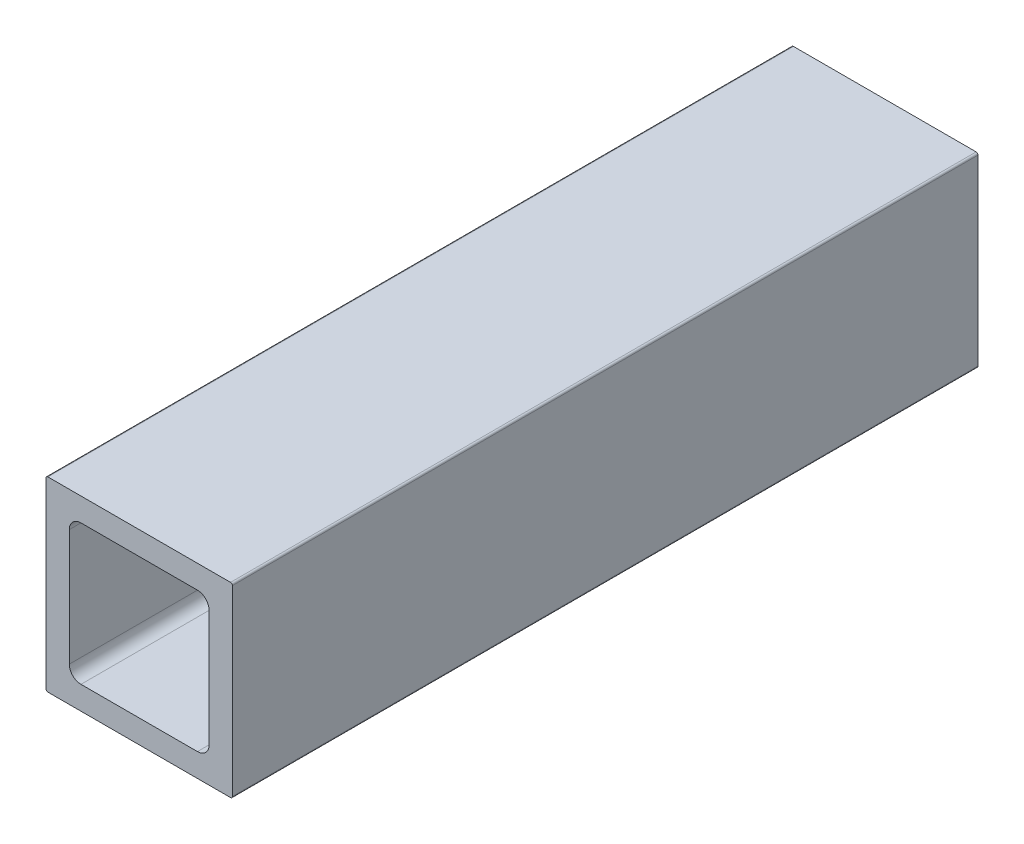
ISO-10303-21;
HEADER;
FILE_DESCRIPTION(('STEP AP214'),'2;1');
FILE_NAME('part.step','',(''),(''),'','','');
FILE_SCHEMA(('AUTOMOTIVE_DESIGN { 1 0 10303 214 1 1 1 1 }'));
ENDSEC;
DATA;
#1=APPLICATION_CONTEXT('core data for automotive mechanical design processes');
#2=APPLICATION_PROTOCOL_DEFINITION('international standard','automotive_design',2000,#1);
#3=PRODUCT_CONTEXT('',#1,'mechanical');
#4=PRODUCT('Part','Part','',(#3));
#5=PRODUCT_RELATED_PRODUCT_CATEGORY('part','',(#4));
#6=PRODUCT_DEFINITION_FORMATION('','',#4);
#7=PRODUCT_DEFINITION_CONTEXT('part definition',#1,'design');
#8=PRODUCT_DEFINITION('design','',#6,#7);
#9=PRODUCT_DEFINITION_SHAPE('','',#8);
#10=(LENGTH_UNIT() NAMED_UNIT(*) SI_UNIT(.MILLI.,.METRE.));
#11=(NAMED_UNIT(*) PLANE_ANGLE_UNIT() SI_UNIT($,.RADIAN.));
#12=(NAMED_UNIT(*) SI_UNIT($,.STERADIAN.) SOLID_ANGLE_UNIT());
#13=UNCERTAINTY_MEASURE_WITH_UNIT(LENGTH_MEASURE(1.E-05),#10,'distance_accuracy_value','');
#14=(GEOMETRIC_REPRESENTATION_CONTEXT(3) GLOBAL_UNCERTAINTY_ASSIGNED_CONTEXT((#13)) GLOBAL_UNIT_ASSIGNED_CONTEXT((#10,
#11,#12)) REPRESENTATION_CONTEXT('',''));
#15=CARTESIAN_POINT('',(0.,0.,0.));
#16=DIRECTION('',(0.,0.,1.));
#17=DIRECTION('',(1.,0.,0.));
#18=AXIS2_PLACEMENT_3D('',#15,#16,#17);
#19=CARTESIAN_POINT('',(3.175,4.7625,1828.8));
#20=DIRECTION('',(1.,0.,0.));
#21=DIRECTION('',(0.,1.,0.));
#22=AXIS2_PLACEMENT_3D('',#19,#20,#21);
#23=PLANE('',#22);
#24=DIRECTION('',(0.,-1.,0.));
#25=VECTOR('',#24,1.);
#26=CARTESIAN_POINT('',(3.175,4.7625,1727.2));
#27=LINE('',#26,#25);
#28=CARTESIAN_POINT('',(3.175,20.6375,1727.2));
#29=VERTEX_POINT('',#28);
#30=CARTESIAN_POINT('',(3.175,4.7625,1727.2));
#31=VERTEX_POINT('',#30);
#32=EDGE_CURVE('E58',#29,#31,#27,.T.);
#33=ORIENTED_EDGE('',*,*,#32,.F.);
#34=DIRECTION('',(0.,0.,-1.));
#35=VECTOR('',#34,1.);
#36=CARTESIAN_POINT('',(3.175,20.6375,1828.8));
#37=LINE('',#36,#35);
#38=CARTESIAN_POINT('',(3.175,20.6375,1828.8));
#39=VERTEX_POINT('',#38);
#40=EDGE_CURVE('E51',#39,#29,#37,.T.);
#41=ORIENTED_EDGE('',*,*,#40,.F.);
#42=DIRECTION('',(0.,-1.,0.));
#43=VECTOR('',#42,1.);
#44=CARTESIAN_POINT('',(3.175,4.7625,1828.8));
#45=LINE('',#44,#43);
#46=CARTESIAN_POINT('',(3.175,4.7625,1828.8));
#47=VERTEX_POINT('',#46);
#48=EDGE_CURVE('E217',#39,#47,#45,.T.);
#49=ORIENTED_EDGE('',*,*,#48,.T.);
#50=DIRECTION('',(0.,0.,-1.));
#51=VECTOR('',#50,1.);
#52=CARTESIAN_POINT('',(3.175,4.7625,1828.8));
#53=LINE('',#52,#51);
#54=EDGE_CURVE('E323',#47,#31,#53,.T.);
#55=ORIENTED_EDGE('',*,*,#54,.T.);
#56=EDGE_LOOP('',(#33,#41,#49,#55));
#57=FACE_BOUND('',#56,.T.);
#58=ADVANCED_FACE('F43',(#57),#23,.T.);
#59=CARTESIAN_POINT('',(4.7625,20.6375,1828.8));
#60=DIRECTION('',(0.,0.,-1.));
#61=DIRECTION('',(-1.,0.,0.));
#62=AXIS2_PLACEMENT_3D('',#59,#60,#61);
#63=CYLINDRICAL_SURFACE('',#62,1.5875);
#64=ORIENTED_EDGE('',*,*,#40,.T.);
#65=CARTESIAN_POINT('',(4.7625,20.6375,1727.2));
#66=DIRECTION('',(0.,0.,1.));
#67=DIRECTION('',(1.,0.,0.));
#68=AXIS2_PLACEMENT_3D('',#65,#66,#67);
#69=CIRCLE('',#68,1.5875);
#70=CARTESIAN_POINT('',(4.7625,22.225,1727.2));
#71=VERTEX_POINT('',#70);
#72=EDGE_CURVE('E302',#29,#71,#69,.F.);
#73=ORIENTED_EDGE('',*,*,#72,.T.);
#74=DIRECTION('',(0.,0.,-1.));
#75=VECTOR('',#74,1.);
#76=CARTESIAN_POINT('',(4.7625,22.225,1828.8));
#77=LINE('',#76,#75);
#78=CARTESIAN_POINT('',(4.7625,22.225,1828.8));
#79=VERTEX_POINT('',#78);
#80=EDGE_CURVE('E290',#79,#71,#77,.T.);
#81=ORIENTED_EDGE('',*,*,#80,.F.);
#82=CARTESIAN_POINT('',(4.7625,20.6375,1828.8));
#83=DIRECTION('',(0.,0.,1.));
#84=DIRECTION('',(-1.,0.,0.));
#85=AXIS2_PLACEMENT_3D('',#82,#83,#84);
#86=CIRCLE('',#85,1.5875);
#87=EDGE_CURVE('E222',#79,#39,#86,.T.);
#88=ORIENTED_EDGE('',*,*,#87,.T.);
#89=EDGE_LOOP('',(#64,#73,#81,#88));
#90=FACE_BOUND('',#89,.T.);
#91=ADVANCED_FACE('F300',(#90),#63,.F.);
#92=CARTESIAN_POINT('',(4.7625,22.225,1828.8));
#93=DIRECTION('',(0.,-1.,0.));
#94=DIRECTION('',(0.,0.,-1.));
#95=AXIS2_PLACEMENT_3D('',#92,#93,#94);
#96=PLANE('',#95);
#97=DIRECTION('',(-1.,0.,0.));
#98=VECTOR('',#97,1.);
#99=CARTESIAN_POINT('',(4.7625,22.225,1727.2));
#100=LINE('',#99,#98);
#101=CARTESIAN_POINT('',(20.6375,22.225,1727.2));
#102=VERTEX_POINT('',#101);
#103=EDGE_CURVE('E338',#102,#71,#100,.T.);
#104=ORIENTED_EDGE('',*,*,#103,.F.);
#105=DIRECTION('',(0.,0.,-1.));
#106=VECTOR('',#105,1.);
#107=CARTESIAN_POINT('',(20.6375,22.225,1828.8));
#108=LINE('',#107,#106);
#109=CARTESIAN_POINT('',(20.6375,22.225,1828.8));
#110=VERTEX_POINT('',#109);
#111=EDGE_CURVE('E237',#110,#102,#108,.T.);
#112=ORIENTED_EDGE('',*,*,#111,.F.);
#113=DIRECTION('',(-1.,0.,0.));
#114=VECTOR('',#113,1.);
#115=CARTESIAN_POINT('',(4.7625,22.225,1828.8));
#116=LINE('',#115,#114);
#117=EDGE_CURVE('E226',#110,#79,#116,.T.);
#118=ORIENTED_EDGE('',*,*,#117,.T.);
#119=ORIENTED_EDGE('',*,*,#80,.T.);
#120=EDGE_LOOP('',(#104,#112,#118,#119));
#121=FACE_BOUND('',#120,.T.);
#122=ADVANCED_FACE('F289',(#121),#96,.T.);
#123=CARTESIAN_POINT('',(20.6375,20.6375,1828.8));
#124=DIRECTION('',(0.,0.,-1.));
#125=DIRECTION('',(-1.,0.,0.));
#126=AXIS2_PLACEMENT_3D('',#123,#124,#125);
#127=CYLINDRICAL_SURFACE('',#126,1.5875);
#128=ORIENTED_EDGE('',*,*,#111,.T.);
#129=CARTESIAN_POINT('',(20.6375,20.6375,1727.2));
#130=DIRECTION('',(0.,0.,1.));
#131=DIRECTION('',(1.,0.,0.));
#132=AXIS2_PLACEMENT_3D('',#129,#130,#131);
#133=CIRCLE('',#132,1.5875);
#134=CARTESIAN_POINT('',(22.225,20.6375,1727.2));
#135=VERTEX_POINT('',#134);
#136=EDGE_CURVE('E340',#102,#135,#133,.F.);
#137=ORIENTED_EDGE('',*,*,#136,.T.);
#138=DIRECTION('',(0.,0.,-1.));
#139=VECTOR('',#138,1.);
#140=CARTESIAN_POINT('',(22.225,20.6375,1828.8));
#141=LINE('',#140,#139);
#142=CARTESIAN_POINT('',(22.225,20.6375,1828.8));
#143=VERTEX_POINT('',#142);
#144=EDGE_CURVE('E233',#143,#135,#141,.T.);
#145=ORIENTED_EDGE('',*,*,#144,.F.);
#146=CARTESIAN_POINT('',(20.6375,20.6375,1828.8));
#147=DIRECTION('',(0.,0.,1.));
#148=DIRECTION('',(-1.,0.,0.));
#149=AXIS2_PLACEMENT_3D('',#146,#147,#148);
#150=CIRCLE('',#149,1.5875);
#151=EDGE_CURVE('E212',#143,#110,#150,.T.);
#152=ORIENTED_EDGE('',*,*,#151,.T.);
#153=EDGE_LOOP('',(#128,#137,#145,#152));
#154=FACE_BOUND('',#153,.T.);
#155=ADVANCED_FACE('F525',(#154),#127,.F.);
#156=CARTESIAN_POINT('',(22.225,4.7625,1828.8));
#157=DIRECTION('',(-1.,0.,0.));
#158=DIRECTION('',(0.,0.,1.));
#159=AXIS2_PLACEMENT_3D('',#156,#157,#158);
#160=PLANE('',#159);
#161=DIRECTION('',(0.,1.,0.));
#162=VECTOR('',#161,1.);
#163=CARTESIAN_POINT('',(22.225,4.7625,1727.2));
#164=LINE('',#163,#162);
#165=CARTESIAN_POINT('',(22.225,4.7625,1727.2));
#166=VERTEX_POINT('',#165);
#167=EDGE_CURVE('E343',#166,#135,#164,.T.);
#168=ORIENTED_EDGE('',*,*,#167,.F.);
#169=DIRECTION('',(0.,0.,-1.));
#170=VECTOR('',#169,1.);
#171=CARTESIAN_POINT('',(22.225,4.7625,1828.8));
#172=LINE('',#171,#170);
#173=CARTESIAN_POINT('',(22.225,4.7625,1828.8));
#174=VERTEX_POINT('',#173);
#175=EDGE_CURVE('E238',#174,#166,#172,.T.);
#176=ORIENTED_EDGE('',*,*,#175,.F.);
#177=DIRECTION('',(0.,1.,0.));
#178=VECTOR('',#177,1.);
#179=CARTESIAN_POINT('',(22.225,4.7625,1828.8));
#180=LINE('',#179,#178);
#181=EDGE_CURVE('E207',#174,#143,#180,.T.);
#182=ORIENTED_EDGE('',*,*,#181,.T.);
#183=ORIENTED_EDGE('',*,*,#144,.T.);
#184=EDGE_LOOP('',(#168,#176,#182,#183));
#185=FACE_BOUND('',#184,.T.);
#186=ADVANCED_FACE('F395',(#185),#160,.T.);
#187=CARTESIAN_POINT('',(20.6375,4.7625,1828.8));
#188=DIRECTION('',(0.,0.,-1.));
#189=DIRECTION('',(-1.,0.,0.));
#190=AXIS2_PLACEMENT_3D('',#187,#188,#189);
#191=CYLINDRICAL_SURFACE('',#190,1.5875);
#192=ORIENTED_EDGE('',*,*,#175,.T.);
#193=CARTESIAN_POINT('',(20.6375,4.7625,1727.2));
#194=DIRECTION('',(0.,0.,1.));
#195=DIRECTION('',(1.,0.,0.));
#196=AXIS2_PLACEMENT_3D('',#193,#194,#195);
#197=CIRCLE('',#196,1.5875);
#198=CARTESIAN_POINT('',(20.6375,3.175,1727.2));
#199=VERTEX_POINT('',#198);
#200=EDGE_CURVE('E345',#166,#199,#197,.F.);
#201=ORIENTED_EDGE('',*,*,#200,.T.);
#202=DIRECTION('',(0.,0.,-1.));
#203=VECTOR('',#202,1.);
#204=CARTESIAN_POINT('',(20.6375,3.175,1828.8));
#205=LINE('',#204,#203);
#206=CARTESIAN_POINT('',(20.6375,3.175,1828.8));
#207=VERTEX_POINT('',#206);
#208=EDGE_CURVE('E264',#207,#199,#205,.T.);
#209=ORIENTED_EDGE('',*,*,#208,.F.);
#210=CARTESIAN_POINT('',(20.6375,4.7625,1828.8));
#211=DIRECTION('',(0.,0.,1.));
#212=DIRECTION('',(-1.,0.,0.));
#213=AXIS2_PLACEMENT_3D('',#210,#211,#212);
#214=CIRCLE('',#213,1.5875);
#215=EDGE_CURVE('E211',#207,#174,#214,.T.);
#216=ORIENTED_EDGE('',*,*,#215,.T.);
#217=EDGE_LOOP('',(#192,#201,#209,#216));
#218=FACE_BOUND('',#217,.T.);
#219=ADVANCED_FACE('F392',(#218),#191,.F.);
#220=CARTESIAN_POINT('',(4.7625,3.175,1828.8));
#221=DIRECTION('',(0.,1.,0.));
#222=DIRECTION('',(1.,0.,0.));
#223=AXIS2_PLACEMENT_3D('',#220,#221,#222);
#224=PLANE('',#223);
#225=DIRECTION('',(1.,0.,0.));
#226=VECTOR('',#225,1.);
#227=CARTESIAN_POINT('',(4.7625,3.175,1727.2));
#228=LINE('',#227,#226);
#229=CARTESIAN_POINT('',(4.7625,3.175,1727.2));
#230=VERTEX_POINT('',#229);
#231=EDGE_CURVE('E348',#230,#199,#228,.T.);
#232=ORIENTED_EDGE('',*,*,#231,.F.);
#233=DIRECTION('',(0.,0.,-1.));
#234=VECTOR('',#233,1.);
#235=CARTESIAN_POINT('',(4.7625,3.175,1828.8));
#236=LINE('',#235,#234);
#237=CARTESIAN_POINT('',(4.7625,3.175,1828.8));
#238=VERTEX_POINT('',#237);
#239=EDGE_CURVE('E268',#238,#230,#236,.T.);
#240=ORIENTED_EDGE('',*,*,#239,.F.);
#241=DIRECTION('',(1.,0.,0.));
#242=VECTOR('',#241,1.);
#243=CARTESIAN_POINT('',(4.7625,3.175,1828.8));
#244=LINE('',#243,#242);
#245=EDGE_CURVE('E254',#238,#207,#244,.T.);
#246=ORIENTED_EDGE('',*,*,#245,.T.);
#247=ORIENTED_EDGE('',*,*,#208,.T.);
#248=EDGE_LOOP('',(#232,#240,#246,#247));
#249=FACE_BOUND('',#248,.T.);
#250=ADVANCED_FACE('F394',(#249),#224,.T.);
#251=CARTESIAN_POINT('',(4.7625,4.7625,1828.8));
#252=DIRECTION('',(0.,0.,-1.));
#253=DIRECTION('',(-1.,0.,0.));
#254=AXIS2_PLACEMENT_3D('',#251,#252,#253);
#255=CYLINDRICAL_SURFACE('',#254,1.5875);
#256=ORIENTED_EDGE('',*,*,#239,.T.);
#257=CARTESIAN_POINT('',(4.7625,4.7625,1727.2));
#258=DIRECTION('',(0.,0.,1.));
#259=DIRECTION('',(1.,0.,0.));
#260=AXIS2_PLACEMENT_3D('',#257,#258,#259);
#261=CIRCLE('',#260,1.5875);
#262=EDGE_CURVE('E350',#230,#31,#261,.F.);
#263=ORIENTED_EDGE('',*,*,#262,.T.);
#264=ORIENTED_EDGE('',*,*,#54,.F.);
#265=CARTESIAN_POINT('',(4.7625,4.7625,1828.8));
#266=DIRECTION('',(0.,0.,1.));
#267=DIRECTION('',(1.,0.,0.));
#268=AXIS2_PLACEMENT_3D('',#265,#266,#267);
#269=CIRCLE('',#268,1.5875);
#270=EDGE_CURVE('E213',#47,#238,#269,.T.);
#271=ORIENTED_EDGE('',*,*,#270,.T.);
#272=EDGE_LOOP('',(#256,#263,#264,#271));
#273=FACE_BOUND('',#272,.T.);
#274=ADVANCED_FACE('F508',(#273),#255,.F.);
#275=CARTESIAN_POINT('',(0.,0.254,1828.8));
#276=DIRECTION('',(1.,0.,0.));
#277=DIRECTION('',(0.,1.,0.));
#278=AXIS2_PLACEMENT_3D('',#275,#276,#277);
#279=PLANE('',#278);
#280=DIRECTION('',(0.,0.,-1.));
#281=VECTOR('',#280,1.);
#282=CARTESIAN_POINT('',(0.,25.146,1828.8));
#283=LINE('',#282,#281);
#284=CARTESIAN_POINT('',(0.,25.146,1828.8));
#285=VERTEX_POINT('',#284);
#286=CARTESIAN_POINT('',(0.,25.146,1727.2));
#287=VERTEX_POINT('',#286);
#288=EDGE_CURVE('E263',#285,#287,#283,.T.);
#289=ORIENTED_EDGE('',*,*,#288,.T.);
#290=DIRECTION('',(0.,-1.,0.));
#291=VECTOR('',#290,1.);
#292=CARTESIAN_POINT('',(0.,0.254,1727.2));
#293=LINE('',#292,#291);
#294=CARTESIAN_POINT('',(0.,0.254,1727.2));
#295=VERTEX_POINT('',#294);
#296=EDGE_CURVE('E185',#287,#295,#293,.T.);
#297=ORIENTED_EDGE('',*,*,#296,.T.);
#298=DIRECTION('',(0.,0.,-1.));
#299=VECTOR('',#298,1.);
#300=CARTESIAN_POINT('',(0.,0.254,1828.8));
#301=LINE('',#300,#299);
#302=CARTESIAN_POINT('',(0.,0.254,1828.8));
#303=VERTEX_POINT('',#302);
#304=EDGE_CURVE('E194',#303,#295,#301,.T.);
#305=ORIENTED_EDGE('',*,*,#304,.F.);
#306=DIRECTION('',(0.,-1.,0.));
#307=VECTOR('',#306,1.);
#308=CARTESIAN_POINT('',(0.,0.254,1828.8));
#309=LINE('',#308,#307);
#310=EDGE_CURVE('E218',#285,#303,#309,.T.);
#311=ORIENTED_EDGE('',*,*,#310,.F.);
#312=EDGE_LOOP('',(#289,#297,#305,#311));
#313=FACE_BOUND('',#312,.T.);
#314=ADVANCED_FACE('F502',(#313),#279,.F.);
#315=CARTESIAN_POINT('',(0.254,25.146,1828.8));
#316=DIRECTION('',(0.,0.,-1.));
#317=DIRECTION('',(-1.,0.,0.));
#318=AXIS2_PLACEMENT_3D('',#315,#316,#317);
#319=CYLINDRICAL_SURFACE('',#318,0.254);
#320=CARTESIAN_POINT('',(0.254,25.146,1727.2));
#321=DIRECTION('',(0.,0.,1.));
#322=DIRECTION('',(1.,0.,0.));
#323=AXIS2_PLACEMENT_3D('',#320,#321,#322);
#324=CIRCLE('',#323,0.254);
#325=CARTESIAN_POINT('',(0.254000000000004,25.4,1727.2));
#326=VERTEX_POINT('',#325);
#327=EDGE_CURVE('E176',#287,#326,#324,.F.);
#328=ORIENTED_EDGE('',*,*,#327,.F.);
#329=ORIENTED_EDGE('',*,*,#288,.F.);
#330=CARTESIAN_POINT('',(0.254,25.146,1828.8));
#331=DIRECTION('',(0.,0.,1.));
#332=DIRECTION('',(-1.,0.,0.));
#333=AXIS2_PLACEMENT_3D('',#330,#331,#332);
#334=CIRCLE('',#333,0.254);
#335=CARTESIAN_POINT('',(0.254,25.4,1828.8));
#336=VERTEX_POINT('',#335);
#337=EDGE_CURVE('E239',#336,#285,#334,.T.);
#338=ORIENTED_EDGE('',*,*,#337,.F.);
#339=DIRECTION('',(0.,0.,-1.));
#340=VECTOR('',#339,1.);
#341=CARTESIAN_POINT('',(0.254,25.4,1828.8));
#342=LINE('',#341,#340);
#343=EDGE_CURVE('E259',#336,#326,#342,.T.);
#344=ORIENTED_EDGE('',*,*,#343,.T.);
#345=EDGE_LOOP('',(#328,#329,#338,#344));
#346=FACE_BOUND('',#345,.T.);
#347=ADVANCED_FACE('F507',(#346),#319,.T.);
#348=CARTESIAN_POINT('',(0.254,25.4,1828.8));
#349=DIRECTION('',(0.,-1.,0.));
#350=DIRECTION('',(0.,0.,-1.));
#351=AXIS2_PLACEMENT_3D('',#348,#349,#350);
#352=PLANE('',#351);
#353=DIRECTION('',(0.,0.,-1.));
#354=VECTOR('',#353,1.);
#355=CARTESIAN_POINT('',(25.146,25.4,1828.8));
#356=LINE('',#355,#354);
#357=CARTESIAN_POINT('',(25.146,25.4,1828.8));
#358=VERTEX_POINT('',#357);
#359=CARTESIAN_POINT('',(25.146,25.4,1727.2));
#360=VERTEX_POINT('',#359);
#361=EDGE_CURVE('E255',#358,#360,#356,.T.);
#362=ORIENTED_EDGE('',*,*,#361,.T.);
#363=DIRECTION('',(1.,0.,0.));
#364=VECTOR('',#363,1.);
#365=CARTESIAN_POINT('',(-135.222379220066,25.4,1727.2));
#366=LINE('',#365,#364);
#367=EDGE_CURVE('E186',#326,#360,#366,.T.);
#368=ORIENTED_EDGE('',*,*,#367,.F.);
#369=ORIENTED_EDGE('',*,*,#343,.F.);
#370=DIRECTION('',(-1.,0.,0.));
#371=VECTOR('',#370,1.);
#372=CARTESIAN_POINT('',(0.254,25.4,1828.8));
#373=LINE('',#372,#371);
#374=EDGE_CURVE('E231',#358,#336,#373,.T.);
#375=ORIENTED_EDGE('',*,*,#374,.F.);
#376=EDGE_LOOP('',(#362,#368,#369,#375));
#377=FACE_BOUND('',#376,.T.);
#378=ADVANCED_FACE('F365',(#377),#352,.F.);
#379=CARTESIAN_POINT('',(25.146,25.146,1828.8));
#380=DIRECTION('',(0.,0.,-1.));
#381=DIRECTION('',(-1.,0.,0.));
#382=AXIS2_PLACEMENT_3D('',#379,#380,#381);
#383=CYLINDRICAL_SURFACE('',#382,0.254);
#384=CARTESIAN_POINT('',(25.146,25.146,1727.2));
#385=DIRECTION('',(0.,0.,1.));
#386=DIRECTION('',(1.,0.,0.));
#387=AXIS2_PLACEMENT_3D('',#384,#385,#386);
#388=CIRCLE('',#387,0.254);
#389=CARTESIAN_POINT('',(25.4,25.146,1727.2));
#390=VERTEX_POINT('',#389);
#391=EDGE_CURVE('E352',#360,#390,#388,.F.);
#392=ORIENTED_EDGE('',*,*,#391,.F.);
#393=ORIENTED_EDGE('',*,*,#361,.F.);
#394=CARTESIAN_POINT('',(25.146,25.146,1828.8));
#395=DIRECTION('',(0.,0.,1.));
#396=DIRECTION('',(-1.,0.,0.));
#397=AXIS2_PLACEMENT_3D('',#394,#395,#396);
#398=CIRCLE('',#397,0.254);
#399=CARTESIAN_POINT('',(25.4,25.146,1828.8));
#400=VERTEX_POINT('',#399);
#401=EDGE_CURVE('E227',#400,#358,#398,.T.);
#402=ORIENTED_EDGE('',*,*,#401,.F.);
#403=DIRECTION('',(0.,0.,-1.));
#404=VECTOR('',#403,1.);
#405=CARTESIAN_POINT('',(25.4,25.146,1828.8));
#406=LINE('',#405,#404);
#407=EDGE_CURVE('E200',#400,#390,#406,.T.);
#408=ORIENTED_EDGE('',*,*,#407,.T.);
#409=EDGE_LOOP('',(#392,#393,#402,#408));
#410=FACE_BOUND('',#409,.T.);
#411=ADVANCED_FACE('F45',(#410),#383,.T.);
#412=CARTESIAN_POINT('',(25.4,0.254,1828.8));
#413=DIRECTION('',(-1.,0.,0.));
#414=DIRECTION('',(0.,0.,1.));
#415=AXIS2_PLACEMENT_3D('',#412,#413,#414);
#416=PLANE('',#415);
#417=DIRECTION('',(0.,0.,-1.));
#418=VECTOR('',#417,1.);
#419=CARTESIAN_POINT('',(25.4,0.254,1828.8));
#420=LINE('',#419,#418);
#421=CARTESIAN_POINT('',(25.4,0.254,1828.8));
#422=VERTEX_POINT('',#421);
#423=CARTESIAN_POINT('',(25.4,0.254,1727.2));
#424=VERTEX_POINT('',#423);
#425=EDGE_CURVE('E193',#422,#424,#420,.T.);
#426=ORIENTED_EDGE('',*,*,#425,.T.);
#427=DIRECTION('',(0.,1.,0.));
#428=VECTOR('',#427,1.);
#429=CARTESIAN_POINT('',(25.4,0.254,1727.2));
#430=LINE('',#429,#428);
#431=EDGE_CURVE('E172',#424,#390,#430,.T.);
#432=ORIENTED_EDGE('',*,*,#431,.T.);
#433=ORIENTED_EDGE('',*,*,#407,.F.);
#434=DIRECTION('',(0.,1.,0.));
#435=VECTOR('',#434,1.);
#436=CARTESIAN_POINT('',(25.4,0.254,1828.8));
#437=LINE('',#436,#435);
#438=EDGE_CURVE('E232',#422,#400,#437,.T.);
#439=ORIENTED_EDGE('',*,*,#438,.F.);
#440=EDGE_LOOP('',(#426,#432,#433,#439));
#441=FACE_BOUND('',#440,.T.);
#442=ADVANCED_FACE('F369',(#441),#416,.F.);
#443=CARTESIAN_POINT('',(25.146,0.254,1828.8));
#444=DIRECTION('',(0.,0.,-1.));
#445=DIRECTION('',(-1.,0.,0.));
#446=AXIS2_PLACEMENT_3D('',#443,#444,#445);
#447=CYLINDRICAL_SURFACE('',#446,0.254);
#448=CARTESIAN_POINT('',(25.146,0.254,1727.2));
#449=DIRECTION('',(0.,0.,1.));
#450=DIRECTION('',(1.,0.,0.));
#451=AXIS2_PLACEMENT_3D('',#448,#449,#450);
#452=CIRCLE('',#451,0.254);
#453=CARTESIAN_POINT('',(25.146,0.,1727.2));
#454=VERTEX_POINT('',#453);
#455=EDGE_CURVE('E169',#424,#454,#452,.F.);
#456=ORIENTED_EDGE('',*,*,#455,.F.);
#457=ORIENTED_EDGE('',*,*,#425,.F.);
#458=CARTESIAN_POINT('',(25.146,0.254,1828.8));
#459=DIRECTION('',(0.,0.,1.));
#460=DIRECTION('',(1.,0.,0.));
#461=AXIS2_PLACEMENT_3D('',#458,#459,#460);
#462=CIRCLE('',#461,0.254);
#463=CARTESIAN_POINT('',(25.146,0.,1828.8));
#464=VERTEX_POINT('',#463);
#465=EDGE_CURVE('E190',#464,#422,#462,.T.);
#466=ORIENTED_EDGE('',*,*,#465,.F.);
#467=DIRECTION('',(0.,0.,-1.));
#468=VECTOR('',#467,1.);
#469=CARTESIAN_POINT('',(25.146,0.,1828.8));
#470=LINE('',#469,#468);
#471=EDGE_CURVE('E182',#464,#454,#470,.T.);
#472=ORIENTED_EDGE('',*,*,#471,.T.);
#473=EDGE_LOOP('',(#456,#457,#466,#472));
#474=FACE_BOUND('',#473,.T.);
#475=ADVANCED_FACE('F188',(#474),#447,.T.);
#476=CARTESIAN_POINT('',(0.254,0.,1828.8));
#477=DIRECTION('',(0.,1.,0.));
#478=DIRECTION('',(1.,0.,0.));
#479=AXIS2_PLACEMENT_3D('',#476,#477,#478);
#480=PLANE('',#479);
#481=DIRECTION('',(0.,0.,-1.));
#482=VECTOR('',#481,1.);
#483=CARTESIAN_POINT('',(0.254,0.,1828.8));
#484=LINE('',#483,#482);
#485=CARTESIAN_POINT('',(0.254,0.,1828.8));
#486=VERTEX_POINT('',#485);
#487=CARTESIAN_POINT('',(0.254,0.,1727.2));
#488=VERTEX_POINT('',#487);
#489=EDGE_CURVE('E184',#486,#488,#484,.T.);
#490=ORIENTED_EDGE('',*,*,#489,.T.);
#491=DIRECTION('',(-1.,0.,0.));
#492=VECTOR('',#491,1.);
#493=CARTESIAN_POINT('',(-135.222379220066,0.,1727.2));
#494=LINE('',#493,#492);
#495=EDGE_CURVE('E65',#454,#488,#494,.T.);
#496=ORIENTED_EDGE('',*,*,#495,.F.);
#497=ORIENTED_EDGE('',*,*,#471,.F.);
#498=DIRECTION('',(1.,0.,0.));
#499=VECTOR('',#498,1.);
#500=CARTESIAN_POINT('',(0.254,0.,1828.8));
#501=LINE('',#500,#499);
#502=EDGE_CURVE('E248',#486,#464,#501,.T.);
#503=ORIENTED_EDGE('',*,*,#502,.F.);
#504=EDGE_LOOP('',(#490,#496,#497,#503));
#505=FACE_BOUND('',#504,.T.);
#506=ADVANCED_FACE('F180',(#505),#480,.F.);
#507=CARTESIAN_POINT('',(0.254,0.254,1828.8));
#508=DIRECTION('',(0.,0.,-1.));
#509=DIRECTION('',(-1.,0.,0.));
#510=AXIS2_PLACEMENT_3D('',#507,#508,#509);
#511=CYLINDRICAL_SURFACE('',#510,0.254);
#512=CARTESIAN_POINT('',(0.254,0.254,1727.2));
#513=DIRECTION('',(0.,0.,1.));
#514=DIRECTION('',(1.,0.,0.));
#515=AXIS2_PLACEMENT_3D('',#512,#513,#514);
#516=CIRCLE('',#515,0.254);
#517=EDGE_CURVE('E11',#488,#295,#516,.F.);
#518=ORIENTED_EDGE('',*,*,#517,.F.);
#519=ORIENTED_EDGE('',*,*,#489,.F.);
#520=CARTESIAN_POINT('',(0.254,0.254,1828.8));
#521=DIRECTION('',(0.,0.,1.));
#522=DIRECTION('',(-1.,0.,0.));
#523=AXIS2_PLACEMENT_3D('',#520,#521,#522);
#524=CIRCLE('',#523,0.254);
#525=EDGE_CURVE('E251',#303,#486,#524,.T.);
#526=ORIENTED_EDGE('',*,*,#525,.F.);
#527=ORIENTED_EDGE('',*,*,#304,.T.);
#528=EDGE_LOOP('',(#518,#519,#526,#527));
#529=FACE_BOUND('',#528,.T.);
#530=ADVANCED_FACE('F388',(#529),#511,.T.);
#531=CARTESIAN_POINT('',(0.254,0.254,1828.8));
#532=DIRECTION('',(0.,0.,-1.));
#533=DIRECTION('',(0.,-1.,0.));
#534=AXIS2_PLACEMENT_3D('',#531,#532,#533);
#535=PLANE('',#534);
#536=ORIENTED_EDGE('',*,*,#270,.F.);
#537=ORIENTED_EDGE('',*,*,#48,.F.);
#538=ORIENTED_EDGE('',*,*,#87,.F.);
#539=ORIENTED_EDGE('',*,*,#117,.F.);
#540=ORIENTED_EDGE('',*,*,#151,.F.);
#541=ORIENTED_EDGE('',*,*,#181,.F.);
#542=ORIENTED_EDGE('',*,*,#215,.F.);
#543=ORIENTED_EDGE('',*,*,#245,.F.);
#544=EDGE_LOOP('',(#536,#537,#538,#539,#540,#541,#542,#543));
#545=FACE_BOUND('',#544,.T.);
#546=ORIENTED_EDGE('',*,*,#525,.T.);
#547=ORIENTED_EDGE('',*,*,#502,.T.);
#548=ORIENTED_EDGE('',*,*,#465,.T.);
#549=ORIENTED_EDGE('',*,*,#438,.T.);
#550=ORIENTED_EDGE('',*,*,#401,.T.);
#551=ORIENTED_EDGE('',*,*,#374,.T.);
#552=ORIENTED_EDGE('',*,*,#337,.T.);
#553=ORIENTED_EDGE('',*,*,#310,.T.);
#554=EDGE_LOOP('',(#546,#547,#548,#549,#550,#551,#552,#553));
#555=FACE_BOUND('',#554,.T.);
#556=ADVANCED_FACE('F296',(#545,#555),#535,.F.);
#557=CARTESIAN_POINT('',(-135.222379220066,-1748.22883004139,1727.2));
#558=DIRECTION('',(0.,0.,1.));
#559=DIRECTION('',(1.,0.,0.));
#560=AXIS2_PLACEMENT_3D('',#557,#558,#559);
#561=PLANE('',#560);
#562=ORIENTED_EDGE('',*,*,#32,.T.);
#563=ORIENTED_EDGE('',*,*,#262,.F.);
#564=ORIENTED_EDGE('',*,*,#231,.T.);
#565=ORIENTED_EDGE('',*,*,#200,.F.);
#566=ORIENTED_EDGE('',*,*,#167,.T.);
#567=ORIENTED_EDGE('',*,*,#136,.F.);
#568=ORIENTED_EDGE('',*,*,#103,.T.);
#569=ORIENTED_EDGE('',*,*,#72,.F.);
#570=EDGE_LOOP('',(#562,#563,#564,#565,#566,#567,#568,#569));
#571=FACE_BOUND('',#570,.T.);
#572=ORIENTED_EDGE('',*,*,#391,.T.);
#573=ORIENTED_EDGE('',*,*,#431,.F.);
#574=ORIENTED_EDGE('',*,*,#455,.T.);
#575=ORIENTED_EDGE('',*,*,#495,.T.);
#576=ORIENTED_EDGE('',*,*,#517,.T.);
#577=ORIENTED_EDGE('',*,*,#296,.F.);
#578=ORIENTED_EDGE('',*,*,#327,.T.);
#579=ORIENTED_EDGE('',*,*,#367,.T.);
#580=EDGE_LOOP('',(#572,#573,#574,#575,#576,#577,#578,#579));
#581=FACE_BOUND('',#580,.T.);
#582=ADVANCED_FACE('F170',(#571,#581),#561,.F.);
#583=CLOSED_SHELL('',(#58,#91,#122,#155,#186,#219,#250,#274,#314,#347,#378,#411,#442,#475,#506,
#530,#556,#582));
#584=MANIFOLD_SOLID_BREP('B2',#583);
#585=ADVANCED_BREP_SHAPE_REPRESENTATION('',(#18,#584),#14);
#586=SHAPE_DEFINITION_REPRESENTATION(#9,#585);
ENDSEC;
END-ISO-10303-21;
